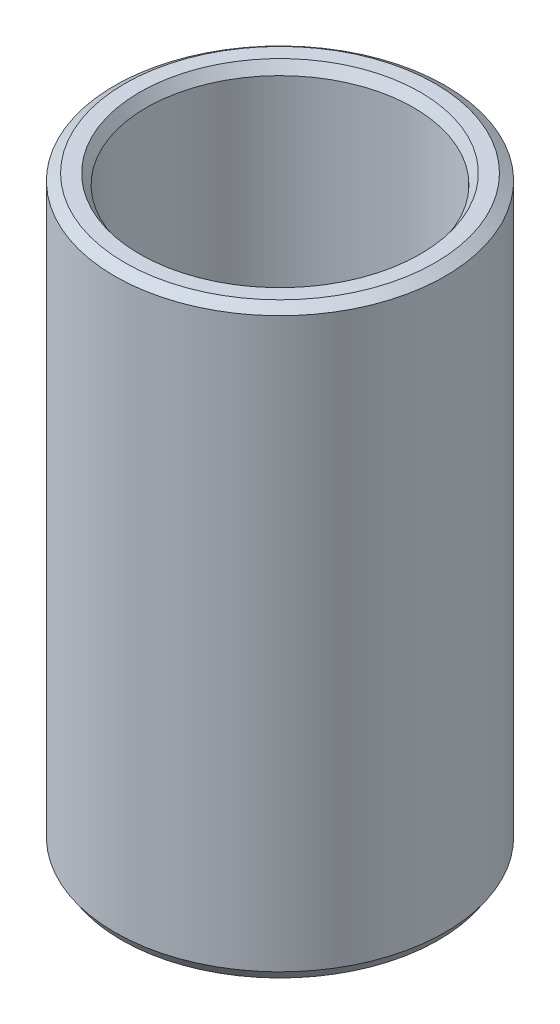
ISO-10303-21;
HEADER;
FILE_DESCRIPTION(('STEP AP214'),'2;1');
FILE_NAME('part.step','',(''),(''),'','','');
FILE_SCHEMA(('AUTOMOTIVE_DESIGN { 1 0 10303 214 1 1 1 1 }'));
ENDSEC;
DATA;
#1=APPLICATION_CONTEXT('core data for automotive mechanical design processes');
#2=APPLICATION_PROTOCOL_DEFINITION('international standard','automotive_design',2000,#1);
#3=PRODUCT_CONTEXT('',#1,'mechanical');
#4=PRODUCT('Part','Part','',(#3));
#5=PRODUCT_RELATED_PRODUCT_CATEGORY('part','',(#4));
#6=PRODUCT_DEFINITION_FORMATION('','',#4);
#7=PRODUCT_DEFINITION_CONTEXT('part definition',#1,'design');
#8=PRODUCT_DEFINITION('design','',#6,#7);
#9=PRODUCT_DEFINITION_SHAPE('','',#8);
#10=(LENGTH_UNIT() NAMED_UNIT(*) SI_UNIT(.MILLI.,.METRE.));
#11=(NAMED_UNIT(*) PLANE_ANGLE_UNIT() SI_UNIT($,.RADIAN.));
#12=(NAMED_UNIT(*) SI_UNIT($,.STERADIAN.) SOLID_ANGLE_UNIT());
#13=UNCERTAINTY_MEASURE_WITH_UNIT(LENGTH_MEASURE(1.E-05),#10,'distance_accuracy_value','');
#14=(GEOMETRIC_REPRESENTATION_CONTEXT(3) GLOBAL_UNCERTAINTY_ASSIGNED_CONTEXT((#13)) GLOBAL_UNIT_ASSIGNED_CONTEXT((#10,
#11,#12)) REPRESENTATION_CONTEXT('',''));
#15=CARTESIAN_POINT('',(0.,0.,0.));
#16=DIRECTION('',(0.,0.,1.));
#17=DIRECTION('',(1.,0.,0.));
#18=AXIS2_PLACEMENT_3D('',#15,#16,#17);
#19=CARTESIAN_POINT('',(0.,141.631600405285,0.));
#20=DIRECTION('',(0.,-1.,0.));
#21=DIRECTION('',(0.,0.,-1.));
#22=AXIS2_PLACEMENT_3D('',#19,#20,#21);
#23=CYLINDRICAL_SURFACE('',#22,40.);
#24=CARTESIAN_POINT('',(0.,2.42762431819066,0.));
#25=DIRECTION('',(0.,1.,0.));
#26=DIRECTION('',(0.,0.,1.));
#27=AXIS2_PLACEMENT_3D('',#24,#25,#26);
#28=CIRCLE('',#27,40.);
#29=CARTESIAN_POINT('',(0.,2.42762431819066,40.));
#30=VERTEX_POINT('',#29);
#31=EDGE_CURVE('E10',#30,#30,#28,.T.);
#32=ORIENTED_EDGE('',*,*,#31,.T.);
#33=EDGE_LOOP('',(#32));
#34=FACE_BOUND('',#33,.T.);
#35=CARTESIAN_POINT('',(0.,140.01318405046,0.));
#36=DIRECTION('',(0.,1.,0.));
#37=DIRECTION('',(0.,0.,1.));
#38=AXIS2_PLACEMENT_3D('',#35,#36,#37);
#39=CIRCLE('',#38,40.);
#40=CARTESIAN_POINT('',(0.,140.01318405046,40.));
#41=VERTEX_POINT('',#40);
#42=EDGE_CURVE('E50',#41,#41,#39,.F.);
#43=ORIENTED_EDGE('',*,*,#42,.T.);
#44=EDGE_LOOP('',(#43));
#45=FACE_BOUND('',#44,.T.);
#46=ADVANCED_FACE('F39',(#34,#45),#23,.T.);
#47=CARTESIAN_POINT('',(0.,141.631600405285,0.));
#48=DIRECTION('',(0.,1.,0.));
#49=DIRECTION('',(0.,0.,1.));
#50=AXIS2_PLACEMENT_3D('',#47,#48,#49);
#51=PLANE('',#50);
#52=CARTESIAN_POINT('',(0.,141.631600405285,0.));
#53=DIRECTION('',(0.,1.,0.));
#54=DIRECTION('',(0.,0.,1.));
#55=AXIS2_PLACEMENT_3D('',#52,#53,#54);
#56=CIRCLE('',#55,33.971343167703);
#57=CARTESIAN_POINT('',(0.,141.631600405285,33.971343167703));
#58=VERTEX_POINT('',#57);
#59=EDGE_CURVE('E58',#58,#58,#56,.F.);
#60=ORIENTED_EDGE('',*,*,#59,.T.);
#61=EDGE_LOOP('',(#60));
#62=FACE_BOUND('',#61,.T.);
#63=CARTESIAN_POINT('',(0.,141.631600405285,0.));
#64=DIRECTION('',(0.,1.,0.));
#65=DIRECTION('',(0.,0.,1.));
#66=AXIS2_PLACEMENT_3D('',#63,#64,#65);
#67=CIRCLE('',#66,37.5723756818093);
#68=CARTESIAN_POINT('',(0.,141.631600405285,37.5723756818093));
#69=VERTEX_POINT('',#68);
#70=EDGE_CURVE('E61',#69,#69,#67,.T.);
#71=ORIENTED_EDGE('',*,*,#70,.T.);
#72=EDGE_LOOP('',(#71));
#73=FACE_BOUND('',#72,.T.);
#74=ADVANCED_FACE('F88',(#62,#73),#51,.T.);
#75=CARTESIAN_POINT('',(0.,0.,0.));
#76=DIRECTION('',(0.,1.,0.));
#77=DIRECTION('',(0.,0.,1.));
#78=AXIS2_PLACEMENT_3D('',#75,#76,#77);
#79=PLANE('',#78);
#80=CARTESIAN_POINT('',(0.,0.,0.));
#81=DIRECTION('',(0.,1.,0.));
#82=DIRECTION('',(0.,0.,1.));
#83=AXIS2_PLACEMENT_3D('',#80,#81,#82);
#84=CIRCLE('',#83,34.7805511310684);
#85=CARTESIAN_POINT('',(0.,0.,34.7805511310684));
#86=VERTEX_POINT('',#85);
#87=EDGE_CURVE('E51',#86,#86,#84,.T.);
#88=ORIENTED_EDGE('',*,*,#87,.T.);
#89=EDGE_LOOP('',(#88));
#90=FACE_BOUND('',#89,.T.);
#91=CARTESIAN_POINT('',(0.,0.,0.));
#92=DIRECTION('',(0.,1.,0.));
#93=DIRECTION('',(0.,0.,1.));
#94=AXIS2_PLACEMENT_3D('',#91,#92,#93);
#95=CIRCLE('',#94,38.3815836451748);
#96=CARTESIAN_POINT('',(0.,0.,38.3815836451748));
#97=VERTEX_POINT('',#96);
#98=EDGE_CURVE('E54',#97,#97,#95,.F.);
#99=ORIENTED_EDGE('',*,*,#98,.T.);
#100=EDGE_LOOP('',(#99));
#101=FACE_BOUND('',#100,.T.);
#102=ADVANCED_FACE('F83',(#90,#101),#79,.F.);
#103=CARTESIAN_POINT('',(0.,141.631600405285,0.));
#104=DIRECTION('',(0.,-1.,0.));
#105=DIRECTION('',(0.,0.,-1.));
#106=AXIS2_PLACEMENT_3D('',#103,#104,#105);
#107=CYLINDRICAL_SURFACE('',#106,32.3529268128777);
#108=CARTESIAN_POINT('',(0.,139.203976087095,0.));
#109=DIRECTION('',(0.,1.,0.));
#110=DIRECTION('',(0.,0.,1.));
#111=AXIS2_PLACEMENT_3D('',#108,#109,#110);
#112=CIRCLE('',#111,32.3529268128777);
#113=CARTESIAN_POINT('',(0.,139.203976087095,32.3529268128777));
#114=VERTEX_POINT('',#113);
#115=EDGE_CURVE('E67',#114,#114,#112,.T.);
#116=ORIENTED_EDGE('',*,*,#115,.T.);
#117=EDGE_LOOP('',(#116));
#118=FACE_BOUND('',#117,.T.);
#119=CARTESIAN_POINT('',(0.,1.61841635482524,0.));
#120=DIRECTION('',(0.,1.,0.));
#121=DIRECTION('',(0.,0.,1.));
#122=AXIS2_PLACEMENT_3D('',#119,#120,#121);
#123=CIRCLE('',#122,32.3529268128777);
#124=CARTESIAN_POINT('',(0.,1.61841635482524,32.3529268128777));
#125=VERTEX_POINT('',#124);
#126=EDGE_CURVE('E69',#125,#125,#123,.F.);
#127=ORIENTED_EDGE('',*,*,#126,.T.);
#128=EDGE_LOOP('',(#127));
#129=FACE_BOUND('',#128,.T.);
#130=ADVANCED_FACE('F71',(#118,#129),#107,.F.);
#131=CARTESIAN_POINT('',(0.,139.203976087095,0.));
#132=DIRECTION('',(0.,1.,0.));
#133=DIRECTION('',(0.,0.,1.));
#134=AXIS2_PLACEMENT_3D('',#131,#132,#133);
#135=CONICAL_SURFACE('',#134,32.3529268128777,0.588002644242075);
#136=ORIENTED_EDGE('',*,*,#59,.F.);
#137=EDGE_LOOP('',(#136));
#138=FACE_BOUND('',#137,.T.);
#139=ORIENTED_EDGE('',*,*,#115,.F.);
#140=EDGE_LOOP('',(#139));
#141=FACE_BOUND('',#140,.T.);
#142=ADVANCED_FACE('F77',(#138,#141),#135,.F.);
#143=CARTESIAN_POINT('',(0.,0.,0.));
#144=DIRECTION('',(0.,-1.,0.));
#145=DIRECTION('',(0.,0.,-1.));
#146=AXIS2_PLACEMENT_3D('',#143,#144,#145);
#147=CONICAL_SURFACE('',#146,34.7805511310684,0.982793682552815);
#148=ORIENTED_EDGE('',*,*,#126,.F.);
#149=EDGE_LOOP('',(#148));
#150=FACE_BOUND('',#149,.T.);
#151=ORIENTED_EDGE('',*,*,#87,.F.);
#152=EDGE_LOOP('',(#151));
#153=FACE_BOUND('',#152,.T.);
#154=ADVANCED_FACE('F73',(#150,#153),#147,.F.);
#155=CARTESIAN_POINT('',(0.,2.42762431819066,0.));
#156=DIRECTION('',(0.,1.,0.));
#157=DIRECTION('',(0.,0.,1.));
#158=AXIS2_PLACEMENT_3D('',#155,#156,#157);
#159=CONICAL_SURFACE('',#158,40.,0.58800264424208);
#160=CARTESIAN_POINT('',(0.,0.,38.3815836451748));
#161=CARTESIAN_POINT('',(0.,0.0252877533144856,38.3984421488709));
#162=CARTESIAN_POINT('',(0.,0.0505755066289716,38.415300652567));
#163=CARTESIAN_POINT('',(0.,0.101151013257944,38.4490176599592));
#164=CARTESIAN_POINT('',(0.,0.12643876657243,38.4658761636553));
#165=CARTESIAN_POINT('',(0.,0.177014273201402,38.4995931710475));
#166=CARTESIAN_POINT('',(0.,0.202302026515888,38.5164516747436));
#167=CARTESIAN_POINT('',(0.,0.25287753314486,38.5501686821358));
#168=CARTESIAN_POINT('',(0.,0.278165286459346,38.5670271858319));
#169=CARTESIAN_POINT('',(0.,0.328740793088318,38.600744193224));
#170=CARTESIAN_POINT('',(0.,0.354028546402804,38.6176026969201));
#171=CARTESIAN_POINT('',(0.,0.404604053031776,38.6513197043123));
#172=CARTESIAN_POINT('',(0.,0.429891806346263,38.6681782080084));
#173=CARTESIAN_POINT('',(0.,0.480467312975234,38.7018952154006));
#174=CARTESIAN_POINT('',(0.,0.505755066289719,38.7187537190967));
#175=CARTESIAN_POINT('',(0.,0.556330572918691,38.7524707264889));
#176=CARTESIAN_POINT('',(0.,0.581618326233178,38.769329230185));
#177=CARTESIAN_POINT('',(0.,0.63219383286215,38.8030462375772));
#178=CARTESIAN_POINT('',(0.,0.657481586176636,38.8199047412733));
#179=CARTESIAN_POINT('',(0.,0.708057092805608,38.8536217486655));
#180=CARTESIAN_POINT('',(0.,0.733344846120094,38.8704802523616));
#181=CARTESIAN_POINT('',(0.,0.783920352749066,38.9041972597538));
#182=CARTESIAN_POINT('',(0.,0.809208106063552,38.9210557634499));
#183=CARTESIAN_POINT('',(0.,0.859783612692524,38.9547727708421));
#184=CARTESIAN_POINT('',(0.,0.88507136600701,38.9716312745382));
#185=CARTESIAN_POINT('',(0.,0.935646872635982,39.0053482819303));
#186=CARTESIAN_POINT('',(0.,0.960934625950468,39.0222067856264));
#187=CARTESIAN_POINT('',(0.,1.01151013257944,39.0559237930186));
#188=CARTESIAN_POINT('',(0.,1.03679788589393,39.0727822967147));
#189=CARTESIAN_POINT('',(0.,1.0873733925229,39.1064993041069));
#190=CARTESIAN_POINT('',(0.,1.11266114583738,39.123357807803));
#191=CARTESIAN_POINT('',(0.,1.16323665246636,39.1570748151952));
#192=CARTESIAN_POINT('',(0.,1.18852440578084,39.1739333188913));
#193=CARTESIAN_POINT('',(0.,1.23909991240981,39.2076503262835));
#194=CARTESIAN_POINT('',(0.,1.2643876657243,39.2245088299796));
#195=CARTESIAN_POINT('',(0.,1.31496317235327,39.2582258373718));
#196=CARTESIAN_POINT('',(0.,1.34025092566776,39.2750843410679));
#197=CARTESIAN_POINT('',(0.,1.39082643229673,39.3088013484601));
#198=CARTESIAN_POINT('',(0.,1.41611418561122,39.3256598521562));
#199=CARTESIAN_POINT('',(0.,1.46668969224019,39.3593768595484));
#200=CARTESIAN_POINT('',(0.,1.49197744555467,39.3762353632445));
#201=CARTESIAN_POINT('',(0.,1.54255295218365,39.4099523706366));
#202=CARTESIAN_POINT('',(0.,1.56784070549813,39.4268108743327));
#203=CARTESIAN_POINT('',(0.,1.61841621212711,39.4605278817249));
#204=CARTESIAN_POINT('',(0.,1.64370396544159,39.477386385421));
#205=CARTESIAN_POINT('',(0.,1.69427947207056,39.5111033928132));
#206=CARTESIAN_POINT('',(0.,1.71956722538505,39.5279618965093));
#207=CARTESIAN_POINT('',(0.,1.77014273201402,39.5616789039015));
#208=CARTESIAN_POINT('',(0.,1.79543048532851,39.5785374075976));
#209=CARTESIAN_POINT('',(0.,1.84600599195748,39.6122544149898));
#210=CARTESIAN_POINT('',(0.,1.87129374527197,39.6291129186859));
#211=CARTESIAN_POINT('',(0.,1.92186925190094,39.6628299260781));
#212=CARTESIAN_POINT('',(0.,1.94715700521542,39.6796884297742));
#213=CARTESIAN_POINT('',(0.,1.9977325118444,39.7134054371664));
#214=CARTESIAN_POINT('',(0.,2.02302026515888,39.7302639408625));
#215=CARTESIAN_POINT('',(0.,2.07359577178785,39.7639809482547));
#216=CARTESIAN_POINT('',(0.,2.09888352510234,39.7808394519508));
#217=CARTESIAN_POINT('',(0.,2.14945903173131,39.8145564593429));
#218=CARTESIAN_POINT('',(0.,2.1747467850458,39.831414963039));
#219=CARTESIAN_POINT('',(0.,2.22532229167477,39.8651319704312));
#220=CARTESIAN_POINT('',(0.,2.25061004498926,39.8819904741273));
#221=CARTESIAN_POINT('',(0.,2.30118555161823,39.9157074815195));
#222=CARTESIAN_POINT('',(0.,2.32647330493271,39.9325659852156));
#223=CARTESIAN_POINT('',(0.,2.37704881156169,39.9662829926078));
#224=CARTESIAN_POINT('',(0.,2.40233656487617,39.9831414963039));
#225=CARTESIAN_POINT('',(0.,2.42762431819066,40.));
#226=B_SPLINE_CURVE_WITH_KNOTS('',3,(#160,#161,#162,#163,#164,#165,#166,#167,#168,#169,#170,
#171,#172,#173,#174,#175,#176,#177,#178,#179,#180,#181,#182,#183,#184,#185,#186,#187,#188,#189,
#190,#191,#192,#193,#194,#195,#196,#197,#198,#199,#200,#201,#202,#203,#204,#205,#206,#207,#208,
#209,#210,#211,#212,#213,#214,#215,#216,#217,#218,#219,#220,#221,#222,#223,#224,#225),
.UNSPECIFIED.,.F.,.F.,(4,2,2,2,2,2,2,2,2,2,2,2,2,2,2,2,2,2,2,2,2,2,2,2,2,2,2,2,2,2,2,2,4),(0.,
0.0911762936902467,0.182352587380493,0.27352888107074,0.364705174760987,0.455881468451233,
0.54705776214148,0.638234055831731,0.729410349521977,0.820586643212224,0.911762936902471,
1.00293923059272,1.09411552428296,1.18529181797321,1.27646811166346,1.3676444053537,
1.45882069904395,1.5499969927342,1.64117328642445,1.7323495801147,1.82352587380494,
1.91470216749519,2.00587846118544,2.09705475487568,2.18823104856593,2.27940734225618,
2.37058363594642,2.46175992963667,2.55293622332692,2.64411251701717,2.73528881070741,
2.82646510439766,2.91764139808791),.UNSPECIFIED.);
#227=EDGE_CURVE('BSEAM76',#97,#30,#226,.T.);
#228=ORIENTED_EDGE('',*,*,#98,.F.);
#229=ORIENTED_EDGE('',*,*,#31,.F.);
#230=ORIENTED_EDGE('',*,*,#227,.T.);
#231=ORIENTED_EDGE('',*,*,#227,.F.);
#232=EDGE_LOOP('',(#228,#230,#229,#231));
#233=FACE_BOUND('',#232,.T.);
#234=ADVANCED_FACE('F76',(#233),#159,.T.);
#235=CARTESIAN_POINT('',(0.,141.631600405285,0.));
#236=DIRECTION('',(0.,-1.,0.));
#237=DIRECTION('',(0.,0.,-1.));
#238=AXIS2_PLACEMENT_3D('',#235,#236,#237);
#239=CONICAL_SURFACE('',#238,37.5723756818093,0.982793682552806);
#240=ORIENTED_EDGE('',*,*,#42,.F.);
#241=EDGE_LOOP('',(#240));
#242=FACE_BOUND('',#241,.T.);
#243=ORIENTED_EDGE('',*,*,#70,.F.);
#244=EDGE_LOOP('',(#243));
#245=FACE_BOUND('',#244,.T.);
#246=ADVANCED_FACE('F45',(#242,#245),#239,.T.);
#247=CLOSED_SHELL('',(#46,#74,#102,#130,#142,#154,#234,#246));
#248=MANIFOLD_SOLID_BREP('B2',#247);
#249=ADVANCED_BREP_SHAPE_REPRESENTATION('',(#18,#248),#14);
#250=SHAPE_DEFINITION_REPRESENTATION(#9,#249);
ENDSEC;
END-ISO-10303-21;
